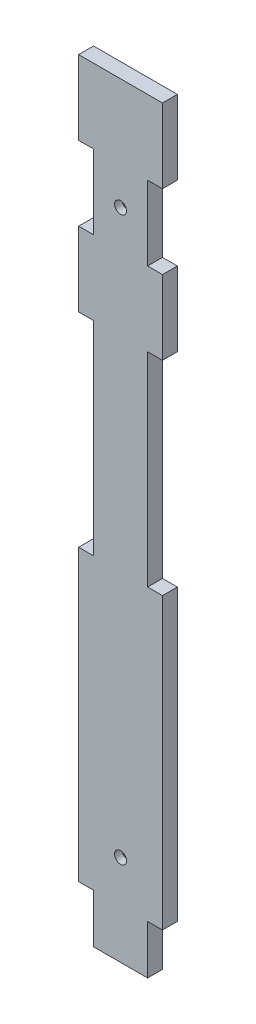
ISO-10303-21;
HEADER;
FILE_DESCRIPTION(('STEP AP214'),'2;1');
FILE_NAME('part.step','',(''),(''),'','','');
FILE_SCHEMA(('AUTOMOTIVE_DESIGN { 1 0 10303 214 1 1 1 1 }'));
ENDSEC;
DATA;
#1=APPLICATION_CONTEXT('core data for automotive mechanical design processes');
#2=APPLICATION_PROTOCOL_DEFINITION('international standard','automotive_design',2000,#1);
#3=PRODUCT_CONTEXT('',#1,'mechanical');
#4=PRODUCT('Part','Part','',(#3));
#5=PRODUCT_RELATED_PRODUCT_CATEGORY('part','',(#4));
#6=PRODUCT_DEFINITION_FORMATION('','',#4);
#7=PRODUCT_DEFINITION_CONTEXT('part definition',#1,'design');
#8=PRODUCT_DEFINITION('design','',#6,#7);
#9=PRODUCT_DEFINITION_SHAPE('','',#8);
#10=(LENGTH_UNIT() NAMED_UNIT(*) SI_UNIT(.MILLI.,.METRE.));
#11=(NAMED_UNIT(*) PLANE_ANGLE_UNIT() SI_UNIT($,.RADIAN.));
#12=(NAMED_UNIT(*) SI_UNIT($,.STERADIAN.) SOLID_ANGLE_UNIT());
#13=UNCERTAINTY_MEASURE_WITH_UNIT(LENGTH_MEASURE(1.E-05),#10,'distance_accuracy_value','');
#14=(GEOMETRIC_REPRESENTATION_CONTEXT(3) GLOBAL_UNCERTAINTY_ASSIGNED_CONTEXT((#13)) GLOBAL_UNIT_ASSIGNED_CONTEXT((#10,
#11,#12)) REPRESENTATION_CONTEXT('',''));
#15=CARTESIAN_POINT('',(0.,0.,0.));
#16=DIRECTION('',(0.,0.,1.));
#17=DIRECTION('',(1.,0.,0.));
#18=AXIS2_PLACEMENT_3D('',#15,#16,#17);
#19=CARTESIAN_POINT('',(0.,0.,10.));
#20=DIRECTION('',(0.,0.,1.));
#21=DIRECTION('',(1.,0.,0.));
#22=AXIS2_PLACEMENT_3D('',#19,#20,#21);
#23=PLANE('',#22);
#24=CARTESIAN_POINT('',(28.2,75.,10.));
#25=DIRECTION('',(0.,0.,1.));
#26=DIRECTION('',(1.,0.,0.));
#27=AXIS2_PLACEMENT_3D('',#24,#25,#26);
#28=CIRCLE('',#27,4.);
#29=CARTESIAN_POINT('',(32.2,75.,10.));
#30=VERTEX_POINT('',#29);
#31=EDGE_CURVE('E231',#30,#30,#28,.T.);
#32=ORIENTED_EDGE('',*,*,#31,.F.);
#33=EDGE_LOOP('',(#32));
#34=FACE_BOUND('',#33,.T.);
#35=DIRECTION('',(1.,0.,0.));
#36=VECTOR('',#35,1.);
#37=CARTESIAN_POINT('',(10.,-1.11022302462516E-13,10.));
#38=LINE('',#37,#36);
#39=CARTESIAN_POINT('',(0.,0.,10.));
#40=VERTEX_POINT('',#39);
#41=CARTESIAN_POINT('',(10.,-1.11022302462516E-13,10.));
#42=VERTEX_POINT('',#41);
#43=EDGE_CURVE('E274',#40,#42,#38,.T.);
#44=ORIENTED_EDGE('',*,*,#43,.T.);
#45=DIRECTION('',(0.,-1.,0.));
#46=VECTOR('',#45,1.);
#47=CARTESIAN_POINT('',(10.,-137.127452116131,10.));
#48=LINE('',#47,#46);
#49=CARTESIAN_POINT('',(10.,-137.127452116131,10.));
#50=VERTEX_POINT('',#49);
#51=EDGE_CURVE('E142',#42,#50,#48,.T.);
#52=ORIENTED_EDGE('',*,*,#51,.T.);
#53=DIRECTION('',(-1.,0.,0.));
#54=VECTOR('',#53,1.);
#55=CARTESIAN_POINT('',(-1.11022302462516E-13,-137.127452116131,10.));
#56=LINE('',#55,#54);
#57=CARTESIAN_POINT('',(-1.11022302462516E-13,-137.127452116131,10.));
#58=VERTEX_POINT('',#57);
#59=EDGE_CURVE('E647',#50,#58,#56,.T.);
#60=ORIENTED_EDGE('',*,*,#59,.T.);
#61=DIRECTION('',(0.,-1.,0.));
#62=VECTOR('',#61,1.);
#63=CARTESIAN_POINT('',(-1.11022302462516E-13,-137.127452116131,10.));
#64=LINE('',#63,#62);
#65=CARTESIAN_POINT('',(0.,-332.021266673399,10.));
#66=VERTEX_POINT('',#65);
#67=EDGE_CURVE('E658',#58,#66,#64,.T.);
#68=ORIENTED_EDGE('',*,*,#67,.T.);
#69=DIRECTION('',(1.,0.,0.));
#70=VECTOR('',#69,1.);
#71=CARTESIAN_POINT('',(0.,-332.021266673399,10.));
#72=LINE('',#71,#70);
#73=CARTESIAN_POINT('',(9.9999999999999,-332.021266673399,10.));
#74=VERTEX_POINT('',#73);
#75=EDGE_CURVE('E655',#66,#74,#72,.T.);
#76=ORIENTED_EDGE('',*,*,#75,.T.);
#77=DIRECTION('',(0.,-1.,0.));
#78=VECTOR('',#77,1.);
#79=CARTESIAN_POINT('',(9.9999999999999,-332.021266673399,10.));
#80=LINE('',#79,#78);
#81=CARTESIAN_POINT('',(9.9999999999999,-364.999999999995,10.));
#82=VERTEX_POINT('',#81);
#83=EDGE_CURVE('E657',#74,#82,#80,.T.);
#84=ORIENTED_EDGE('',*,*,#83,.T.);
#85=DIRECTION('',(1.,0.,0.));
#86=VECTOR('',#85,1.);
#87=CARTESIAN_POINT('',(9.9999999999999,-364.999999999995,10.));
#88=LINE('',#87,#86);
#89=CARTESIAN_POINT('',(46.399999999999,-364.999999999996,10.));
#90=VERTEX_POINT('',#89);
#91=EDGE_CURVE('E660',#82,#90,#88,.T.);
#92=ORIENTED_EDGE('',*,*,#91,.T.);
#93=DIRECTION('',(0.,1.,0.));
#94=VECTOR('',#93,1.);
#95=CARTESIAN_POINT('',(46.399999999999,-364.999999999996,10.));
#96=LINE('',#95,#94);
#97=CARTESIAN_POINT('',(46.399999999999,-332.021266673399,10.));
#98=VERTEX_POINT('',#97);
#99=EDGE_CURVE('E666',#90,#98,#96,.T.);
#100=ORIENTED_EDGE('',*,*,#99,.T.);
#101=DIRECTION('',(1.,0.,0.));
#102=VECTOR('',#101,1.);
#103=CARTESIAN_POINT('',(46.399999999999,-332.021266673399,10.));
#104=LINE('',#103,#102);
#105=CARTESIAN_POINT('',(56.399999999999,-332.021266673399,10.));
#106=VERTEX_POINT('',#105);
#107=EDGE_CURVE('E668',#98,#106,#104,.T.);
#108=ORIENTED_EDGE('',*,*,#107,.T.);
#109=DIRECTION('',(0.,1.,0.));
#110=VECTOR('',#109,1.);
#111=CARTESIAN_POINT('',(56.399999999999,-332.021266673399,10.));
#112=LINE('',#111,#110);
#113=CARTESIAN_POINT('',(56.3999999999991,-137.127452116132,10.));
#114=VERTEX_POINT('',#113);
#115=EDGE_CURVE('E670',#106,#114,#112,.T.);
#116=ORIENTED_EDGE('',*,*,#115,.T.);
#117=DIRECTION('',(-1.,0.,0.));
#118=VECTOR('',#117,1.);
#119=CARTESIAN_POINT('',(46.399999999999,-137.127452116132,10.));
#120=LINE('',#119,#118);
#121=CARTESIAN_POINT('',(46.399999999999,-137.127452116132,10.));
#122=VERTEX_POINT('',#121);
#123=EDGE_CURVE('E672',#114,#122,#120,.T.);
#124=ORIENTED_EDGE('',*,*,#123,.T.);
#125=DIRECTION('',(0.,1.,0.));
#126=VECTOR('',#125,1.);
#127=CARTESIAN_POINT('',(46.399999999999,-6.66133814775094E-13,10.));
#128=LINE('',#127,#126);
#129=CARTESIAN_POINT('',(46.399999999999,-6.66133814775094E-13,10.));
#130=VERTEX_POINT('',#129);
#131=EDGE_CURVE('E674',#122,#130,#128,.T.);
#132=ORIENTED_EDGE('',*,*,#131,.T.);
#133=DIRECTION('',(1.,0.,0.));
#134=VECTOR('',#133,1.);
#135=CARTESIAN_POINT('',(56.4,0.,10.));
#136=LINE('',#135,#134);
#137=CARTESIAN_POINT('',(56.4,0.,10.));
#138=VERTEX_POINT('',#137);
#139=EDGE_CURVE('E676',#130,#138,#136,.T.);
#140=ORIENTED_EDGE('',*,*,#139,.T.);
#141=DIRECTION('',(0.,1.,0.));
#142=VECTOR('',#141,1.);
#143=CARTESIAN_POINT('',(56.4,50.,10.));
#144=LINE('',#143,#142);
#145=CARTESIAN_POINT('',(56.4,50.,10.));
#146=VERTEX_POINT('',#145);
#147=EDGE_CURVE('E678',#138,#146,#144,.T.);
#148=ORIENTED_EDGE('',*,*,#147,.T.);
#149=DIRECTION('',(-1.,0.,0.));
#150=VECTOR('',#149,1.);
#151=CARTESIAN_POINT('',(46.4,50.,10.));
#152=LINE('',#151,#150);
#153=CARTESIAN_POINT('',(46.4,50.,10.));
#154=VERTEX_POINT('',#153);
#155=EDGE_CURVE('E680',#146,#154,#152,.T.);
#156=ORIENTED_EDGE('',*,*,#155,.T.);
#157=DIRECTION('',(0.,1.,0.));
#158=VECTOR('',#157,1.);
#159=CARTESIAN_POINT('',(46.4,100.,10.));
#160=LINE('',#159,#158);
#161=CARTESIAN_POINT('',(46.4,100.,10.));
#162=VERTEX_POINT('',#161);
#163=EDGE_CURVE('E682',#154,#162,#160,.T.);
#164=ORIENTED_EDGE('',*,*,#163,.T.);
#165=DIRECTION('',(1.,0.,0.));
#166=VECTOR('',#165,1.);
#167=CARTESIAN_POINT('',(56.4,100.,10.));
#168=LINE('',#167,#166);
#169=CARTESIAN_POINT('',(56.4,100.,10.));
#170=VERTEX_POINT('',#169);
#171=EDGE_CURVE('E684',#162,#170,#168,.T.);
#172=ORIENTED_EDGE('',*,*,#171,.T.);
#173=DIRECTION('',(0.,1.,0.));
#174=VECTOR('',#173,1.);
#175=CARTESIAN_POINT('',(56.4,150.,10.));
#176=LINE('',#175,#174);
#177=CARTESIAN_POINT('',(56.4,150.,10.));
#178=VERTEX_POINT('',#177);
#179=EDGE_CURVE('E686',#170,#178,#176,.T.);
#180=ORIENTED_EDGE('',*,*,#179,.T.);
#181=DIRECTION('',(-1.,0.,0.));
#182=VECTOR('',#181,1.);
#183=CARTESIAN_POINT('',(0.,150.,10.));
#184=LINE('',#183,#182);
#185=CARTESIAN_POINT('',(0.,150.,10.));
#186=VERTEX_POINT('',#185);
#187=EDGE_CURVE('E688',#178,#186,#184,.T.);
#188=ORIENTED_EDGE('',*,*,#187,.T.);
#189=DIRECTION('',(0.,-1.,0.));
#190=VECTOR('',#189,1.);
#191=CARTESIAN_POINT('',(0.,150.,10.));
#192=LINE('',#191,#190);
#193=CARTESIAN_POINT('',(0.,100.,10.));
#194=VERTEX_POINT('',#193);
#195=EDGE_CURVE('E690',#186,#194,#192,.T.);
#196=ORIENTED_EDGE('',*,*,#195,.T.);
#197=DIRECTION('',(1.,0.,0.));
#198=VECTOR('',#197,1.);
#199=CARTESIAN_POINT('',(0.,100.,10.));
#200=LINE('',#199,#198);
#201=CARTESIAN_POINT('',(9.99999999999997,100.,10.));
#202=VERTEX_POINT('',#201);
#203=EDGE_CURVE('E209',#194,#202,#200,.T.);
#204=ORIENTED_EDGE('',*,*,#203,.T.);
#205=DIRECTION('',(0.,-1.,0.));
#206=VECTOR('',#205,1.);
#207=CARTESIAN_POINT('',(9.99999999999997,100.,10.));
#208=LINE('',#207,#206);
#209=CARTESIAN_POINT('',(9.99999999999996,50.,10.));
#210=VERTEX_POINT('',#209);
#211=EDGE_CURVE('E203',#202,#210,#208,.T.);
#212=ORIENTED_EDGE('',*,*,#211,.T.);
#213=DIRECTION('',(-1.,0.,0.));
#214=VECTOR('',#213,1.);
#215=CARTESIAN_POINT('',(9.99999999999996,50.,10.));
#216=LINE('',#215,#214);
#217=CARTESIAN_POINT('',(0.,50.,10.));
#218=VERTEX_POINT('',#217);
#219=EDGE_CURVE('E207',#210,#218,#216,.T.);
#220=ORIENTED_EDGE('',*,*,#219,.T.);
#221=DIRECTION('',(0.,-1.,0.));
#222=VECTOR('',#221,1.);
#223=CARTESIAN_POINT('',(0.,50.,10.));
#224=LINE('',#223,#222);
#225=EDGE_CURVE('E50',#218,#40,#224,.T.);
#226=ORIENTED_EDGE('',*,*,#225,.T.);
#227=EDGE_LOOP('',(#44,#52,#60,#68,#76,#84,#92,#100,#108,#116,#124,#132,#140,#148,#156,#164,
#172,#180,#188,#196,#204,#212,#220,#226));
#228=FACE_BOUND('',#227,.T.);
#229=CARTESIAN_POINT('',(28.2,-303.821266673398,10.));
#230=DIRECTION('',(0.,0.,1.));
#231=DIRECTION('',(1.,0.,0.));
#232=AXIS2_PLACEMENT_3D('',#229,#230,#231);
#233=CIRCLE('',#232,4.);
#234=CARTESIAN_POINT('',(32.2,-303.821266673398,10.));
#235=VERTEX_POINT('',#234);
#236=EDGE_CURVE('E740',#235,#235,#233,.T.);
#237=ORIENTED_EDGE('',*,*,#236,.F.);
#238=EDGE_LOOP('',(#237));
#239=FACE_BOUND('',#238,.T.);
#240=ADVANCED_FACE('F33',(#34,#228,#239),#23,.T.);
#241=CARTESIAN_POINT('',(0.,0.,0.));
#242=DIRECTION('',(0.,0.,1.));
#243=DIRECTION('',(1.,0.,0.));
#244=AXIS2_PLACEMENT_3D('',#241,#242,#243);
#245=PLANE('',#244);
#246=CARTESIAN_POINT('',(28.2,-303.821266673398,0.));
#247=DIRECTION('',(0.,0.,1.));
#248=DIRECTION('',(1.,0.,0.));
#249=AXIS2_PLACEMENT_3D('',#246,#247,#248);
#250=CIRCLE('',#249,9.00000000000007);
#251=CARTESIAN_POINT('',(37.2,-303.821266673398,0.));
#252=VERTEX_POINT('',#251);
#253=EDGE_CURVE('E340',#252,#252,#250,.T.);
#254=ORIENTED_EDGE('',*,*,#253,.T.);
#255=EDGE_LOOP('',(#254));
#256=FACE_BOUND('',#255,.T.);
#257=CARTESIAN_POINT('',(28.2,75.,0.));
#258=DIRECTION('',(0.,0.,1.));
#259=DIRECTION('',(1.,0.,0.));
#260=AXIS2_PLACEMENT_3D('',#257,#258,#259);
#261=CIRCLE('',#260,9.00000000000006);
#262=CARTESIAN_POINT('',(37.2000000000001,75.,0.));
#263=VERTEX_POINT('',#262);
#264=EDGE_CURVE('E337',#263,#263,#261,.T.);
#265=ORIENTED_EDGE('',*,*,#264,.T.);
#266=EDGE_LOOP('',(#265));
#267=FACE_BOUND('',#266,.T.);
#268=DIRECTION('',(1.,0.,0.));
#269=VECTOR('',#268,1.);
#270=CARTESIAN_POINT('',(10.,-1.11022302462516E-13,0.));
#271=LINE('',#270,#269);
#272=CARTESIAN_POINT('',(0.,0.,0.));
#273=VERTEX_POINT('',#272);
#274=CARTESIAN_POINT('',(10.,-1.11022302462516E-13,0.));
#275=VERTEX_POINT('',#274);
#276=EDGE_CURVE('E227',#273,#275,#271,.T.);
#277=ORIENTED_EDGE('',*,*,#276,.F.);
#278=DIRECTION('',(0.,-1.,0.));
#279=VECTOR('',#278,1.);
#280=CARTESIAN_POINT('',(0.,50.,0.));
#281=LINE('',#280,#279);
#282=CARTESIAN_POINT('',(0.,50.,0.));
#283=VERTEX_POINT('',#282);
#284=EDGE_CURVE('E133',#283,#273,#281,.T.);
#285=ORIENTED_EDGE('',*,*,#284,.F.);
#286=DIRECTION('',(-1.,0.,0.));
#287=VECTOR('',#286,1.);
#288=CARTESIAN_POINT('',(9.99999999999996,50.,0.));
#289=LINE('',#288,#287);
#290=CARTESIAN_POINT('',(9.99999999999996,50.,0.));
#291=VERTEX_POINT('',#290);
#292=EDGE_CURVE('E127',#291,#283,#289,.T.);
#293=ORIENTED_EDGE('',*,*,#292,.F.);
#294=DIRECTION('',(0.,-1.,0.));
#295=VECTOR('',#294,1.);
#296=CARTESIAN_POINT('',(9.99999999999997,100.,0.));
#297=LINE('',#296,#295);
#298=CARTESIAN_POINT('',(9.99999999999997,100.,0.));
#299=VERTEX_POINT('',#298);
#300=EDGE_CURVE('E217',#299,#291,#297,.T.);
#301=ORIENTED_EDGE('',*,*,#300,.F.);
#302=DIRECTION('',(1.,0.,0.));
#303=VECTOR('',#302,1.);
#304=CARTESIAN_POINT('',(0.,100.,0.));
#305=LINE('',#304,#303);
#306=CARTESIAN_POINT('',(0.,100.,0.));
#307=VERTEX_POINT('',#306);
#308=EDGE_CURVE('E269',#307,#299,#305,.T.);
#309=ORIENTED_EDGE('',*,*,#308,.F.);
#310=DIRECTION('',(0.,-1.,0.));
#311=VECTOR('',#310,1.);
#312=CARTESIAN_POINT('',(0.,150.,0.));
#313=LINE('',#312,#311);
#314=CARTESIAN_POINT('',(0.,150.,0.));
#315=VERTEX_POINT('',#314);
#316=EDGE_CURVE('E267',#315,#307,#313,.T.);
#317=ORIENTED_EDGE('',*,*,#316,.F.);
#318=DIRECTION('',(-1.,0.,0.));
#319=VECTOR('',#318,1.);
#320=CARTESIAN_POINT('',(0.,150.,0.));
#321=LINE('',#320,#319);
#322=CARTESIAN_POINT('',(56.4,150.,0.));
#323=VERTEX_POINT('',#322);
#324=EDGE_CURVE('E265',#323,#315,#321,.T.);
#325=ORIENTED_EDGE('',*,*,#324,.F.);
#326=DIRECTION('',(0.,1.,0.));
#327=VECTOR('',#326,1.);
#328=CARTESIAN_POINT('',(56.4,150.,0.));
#329=LINE('',#328,#327);
#330=CARTESIAN_POINT('',(56.4,100.,0.));
#331=VERTEX_POINT('',#330);
#332=EDGE_CURVE('E263',#331,#323,#329,.T.);
#333=ORIENTED_EDGE('',*,*,#332,.F.);
#334=DIRECTION('',(1.,0.,0.));
#335=VECTOR('',#334,1.);
#336=CARTESIAN_POINT('',(56.4,100.,0.));
#337=LINE('',#336,#335);
#338=CARTESIAN_POINT('',(46.4,100.,0.));
#339=VERTEX_POINT('',#338);
#340=EDGE_CURVE('E261',#339,#331,#337,.T.);
#341=ORIENTED_EDGE('',*,*,#340,.F.);
#342=DIRECTION('',(0.,1.,0.));
#343=VECTOR('',#342,1.);
#344=CARTESIAN_POINT('',(46.4,100.,0.));
#345=LINE('',#344,#343);
#346=CARTESIAN_POINT('',(46.4,50.,0.));
#347=VERTEX_POINT('',#346);
#348=EDGE_CURVE('E259',#347,#339,#345,.T.);
#349=ORIENTED_EDGE('',*,*,#348,.F.);
#350=DIRECTION('',(-1.,0.,0.));
#351=VECTOR('',#350,1.);
#352=CARTESIAN_POINT('',(46.4,50.,0.));
#353=LINE('',#352,#351);
#354=CARTESIAN_POINT('',(56.4,50.,0.));
#355=VERTEX_POINT('',#354);
#356=EDGE_CURVE('E257',#355,#347,#353,.T.);
#357=ORIENTED_EDGE('',*,*,#356,.F.);
#358=DIRECTION('',(0.,1.,0.));
#359=VECTOR('',#358,1.);
#360=CARTESIAN_POINT('',(56.4,50.,0.));
#361=LINE('',#360,#359);
#362=CARTESIAN_POINT('',(56.4,0.,0.));
#363=VERTEX_POINT('',#362);
#364=EDGE_CURVE('E255',#363,#355,#361,.T.);
#365=ORIENTED_EDGE('',*,*,#364,.F.);
#366=DIRECTION('',(1.,0.,0.));
#367=VECTOR('',#366,1.);
#368=CARTESIAN_POINT('',(56.4,0.,0.));
#369=LINE('',#368,#367);
#370=CARTESIAN_POINT('',(46.399999999999,-6.66133814775094E-13,0.));
#371=VERTEX_POINT('',#370);
#372=EDGE_CURVE('E253',#371,#363,#369,.T.);
#373=ORIENTED_EDGE('',*,*,#372,.F.);
#374=DIRECTION('',(0.,1.,0.));
#375=VECTOR('',#374,1.);
#376=CARTESIAN_POINT('',(46.399999999999,-6.66133814775094E-13,0.));
#377=LINE('',#376,#375);
#378=CARTESIAN_POINT('',(46.399999999999,-137.127452116132,0.));
#379=VERTEX_POINT('',#378);
#380=EDGE_CURVE('E251',#379,#371,#377,.T.);
#381=ORIENTED_EDGE('',*,*,#380,.F.);
#382=DIRECTION('',(-1.,0.,0.));
#383=VECTOR('',#382,1.);
#384=CARTESIAN_POINT('',(46.399999999999,-137.127452116132,0.));
#385=LINE('',#384,#383);
#386=CARTESIAN_POINT('',(56.3999999999991,-137.127452116132,0.));
#387=VERTEX_POINT('',#386);
#388=EDGE_CURVE('E249',#387,#379,#385,.T.);
#389=ORIENTED_EDGE('',*,*,#388,.F.);
#390=DIRECTION('',(0.,1.,0.));
#391=VECTOR('',#390,1.);
#392=CARTESIAN_POINT('',(56.399999999999,-332.021266673399,0.));
#393=LINE('',#392,#391);
#394=CARTESIAN_POINT('',(56.399999999999,-332.021266673399,0.));
#395=VERTEX_POINT('',#394);
#396=EDGE_CURVE('E247',#395,#387,#393,.T.);
#397=ORIENTED_EDGE('',*,*,#396,.F.);
#398=DIRECTION('',(1.,0.,0.));
#399=VECTOR('',#398,1.);
#400=CARTESIAN_POINT('',(46.399999999999,-332.021266673399,0.));
#401=LINE('',#400,#399);
#402=CARTESIAN_POINT('',(46.399999999999,-332.021266673399,0.));
#403=VERTEX_POINT('',#402);
#404=EDGE_CURVE('E245',#403,#395,#401,.T.);
#405=ORIENTED_EDGE('',*,*,#404,.F.);
#406=DIRECTION('',(0.,1.,0.));
#407=VECTOR('',#406,1.);
#408=CARTESIAN_POINT('',(46.399999999999,-364.999999999996,0.));
#409=LINE('',#408,#407);
#410=CARTESIAN_POINT('',(46.399999999999,-364.999999999996,0.));
#411=VERTEX_POINT('',#410);
#412=EDGE_CURVE('E243',#411,#403,#409,.T.);
#413=ORIENTED_EDGE('',*,*,#412,.F.);
#414=DIRECTION('',(1.,0.,0.));
#415=VECTOR('',#414,1.);
#416=CARTESIAN_POINT('',(9.9999999999999,-364.999999999995,0.));
#417=LINE('',#416,#415);
#418=CARTESIAN_POINT('',(9.9999999999999,-364.999999999995,0.));
#419=VERTEX_POINT('',#418);
#420=EDGE_CURVE('E241',#419,#411,#417,.T.);
#421=ORIENTED_EDGE('',*,*,#420,.F.);
#422=DIRECTION('',(0.,-1.,0.));
#423=VECTOR('',#422,1.);
#424=CARTESIAN_POINT('',(9.9999999999999,-332.021266673399,0.));
#425=LINE('',#424,#423);
#426=CARTESIAN_POINT('',(9.9999999999999,-332.021266673399,0.));
#427=VERTEX_POINT('',#426);
#428=EDGE_CURVE('E239',#427,#419,#425,.T.);
#429=ORIENTED_EDGE('',*,*,#428,.F.);
#430=DIRECTION('',(1.,0.,0.));
#431=VECTOR('',#430,1.);
#432=CARTESIAN_POINT('',(0.,-332.021266673399,0.));
#433=LINE('',#432,#431);
#434=CARTESIAN_POINT('',(0.,-332.021266673399,0.));
#435=VERTEX_POINT('',#434);
#436=EDGE_CURVE('E237',#435,#427,#433,.T.);
#437=ORIENTED_EDGE('',*,*,#436,.F.);
#438=DIRECTION('',(0.,-1.,0.));
#439=VECTOR('',#438,1.);
#440=CARTESIAN_POINT('',(-1.11022302462516E-13,-137.127452116131,0.));
#441=LINE('',#440,#439);
#442=CARTESIAN_POINT('',(-1.11022302462516E-13,-137.127452116131,0.));
#443=VERTEX_POINT('',#442);
#444=EDGE_CURVE('E235',#443,#435,#441,.T.);
#445=ORIENTED_EDGE('',*,*,#444,.F.);
#446=DIRECTION('',(-1.,0.,0.));
#447=VECTOR('',#446,1.);
#448=CARTESIAN_POINT('',(-1.11022302462516E-13,-137.127452116131,0.));
#449=LINE('',#448,#447);
#450=CARTESIAN_POINT('',(10.,-137.127452116131,0.));
#451=VERTEX_POINT('',#450);
#452=EDGE_CURVE('E233',#451,#443,#449,.T.);
#453=ORIENTED_EDGE('',*,*,#452,.F.);
#454=DIRECTION('',(0.,-1.,0.));
#455=VECTOR('',#454,1.);
#456=CARTESIAN_POINT('',(10.,-137.127452116131,0.));
#457=LINE('',#456,#455);
#458=EDGE_CURVE('E230',#275,#451,#457,.T.);
#459=ORIENTED_EDGE('',*,*,#458,.F.);
#460=EDGE_LOOP('',(#277,#285,#293,#301,#309,#317,#325,#333,#341,#349,#357,#365,#373,#381,#389,
#397,#405,#413,#421,#429,#437,#445,#453,#459));
#461=FACE_BOUND('',#460,.T.);
#462=ADVANCED_FACE('F353',(#256,#267,#461),#245,.F.);
#463=CARTESIAN_POINT('',(10.,-1.11022302462516E-13,10.));
#464=DIRECTION('',(0.,1.,0.));
#465=DIRECTION('',(-1.,0.,0.));
#466=AXIS2_PLACEMENT_3D('',#463,#464,#465);
#467=PLANE('',#466);
#468=ORIENTED_EDGE('',*,*,#276,.T.);
#469=DIRECTION('',(0.,0.,-1.));
#470=VECTOR('',#469,1.);
#471=CARTESIAN_POINT('',(10.,-1.11022302462516E-13,10.));
#472=LINE('',#471,#470);
#473=EDGE_CURVE('E335',#42,#275,#472,.T.);
#474=ORIENTED_EDGE('',*,*,#473,.F.);
#475=ORIENTED_EDGE('',*,*,#43,.F.);
#476=DIRECTION('',(0.,0.,-1.));
#477=VECTOR('',#476,1.);
#478=CARTESIAN_POINT('',(0.,0.,10.));
#479=LINE('',#478,#477);
#480=EDGE_CURVE('E223',#40,#273,#479,.T.);
#481=ORIENTED_EDGE('',*,*,#480,.T.);
#482=EDGE_LOOP('',(#468,#474,#475,#481));
#483=FACE_BOUND('',#482,.T.);
#484=ADVANCED_FACE('F356',(#483),#467,.F.);
#485=CARTESIAN_POINT('',(10.,-137.127452116131,10.));
#486=DIRECTION('',(1.,0.,0.));
#487=DIRECTION('',(0.,0.,-1.));
#488=AXIS2_PLACEMENT_3D('',#485,#486,#487);
#489=PLANE('',#488);
#490=ORIENTED_EDGE('',*,*,#458,.T.);
#491=DIRECTION('',(0.,0.,-1.));
#492=VECTOR('',#491,1.);
#493=CARTESIAN_POINT('',(10.,-137.127452116131,10.));
#494=LINE('',#493,#492);
#495=EDGE_CURVE('E332',#50,#451,#494,.T.);
#496=ORIENTED_EDGE('',*,*,#495,.F.);
#497=ORIENTED_EDGE('',*,*,#51,.F.);
#498=ORIENTED_EDGE('',*,*,#473,.T.);
#499=EDGE_LOOP('',(#490,#496,#497,#498));
#500=FACE_BOUND('',#499,.T.);
#501=ADVANCED_FACE('F596',(#500),#489,.F.);
#502=CARTESIAN_POINT('',(-1.11022302462516E-13,-137.127452116131,10.));
#503=DIRECTION('',(0.,-1.,0.));
#504=DIRECTION('',(0.,0.,-1.));
#505=AXIS2_PLACEMENT_3D('',#502,#503,#504);
#506=PLANE('',#505);
#507=ORIENTED_EDGE('',*,*,#452,.T.);
#508=DIRECTION('',(0.,0.,-1.));
#509=VECTOR('',#508,1.);
#510=CARTESIAN_POINT('',(-1.11022302462516E-13,-137.127452116131,10.));
#511=LINE('',#510,#509);
#512=EDGE_CURVE('E329',#58,#443,#511,.T.);
#513=ORIENTED_EDGE('',*,*,#512,.F.);
#514=ORIENTED_EDGE('',*,*,#59,.F.);
#515=ORIENTED_EDGE('',*,*,#495,.T.);
#516=EDGE_LOOP('',(#507,#513,#514,#515));
#517=FACE_BOUND('',#516,.T.);
#518=ADVANCED_FACE('F587',(#517),#506,.F.);
#519=CARTESIAN_POINT('',(-1.11022302462516E-13,-137.127452116131,10.));
#520=DIRECTION('',(1.,0.,0.));
#521=DIRECTION('',(0.,1.,0.));
#522=AXIS2_PLACEMENT_3D('',#519,#520,#521);
#523=PLANE('',#522);
#524=ORIENTED_EDGE('',*,*,#444,.T.);
#525=DIRECTION('',(0.,0.,-1.));
#526=VECTOR('',#525,1.);
#527=CARTESIAN_POINT('',(0.,-332.021266673399,10.));
#528=LINE('',#527,#526);
#529=EDGE_CURVE('E326',#66,#435,#528,.T.);
#530=ORIENTED_EDGE('',*,*,#529,.F.);
#531=ORIENTED_EDGE('',*,*,#67,.F.);
#532=ORIENTED_EDGE('',*,*,#512,.T.);
#533=EDGE_LOOP('',(#524,#530,#531,#532));
#534=FACE_BOUND('',#533,.T.);
#535=ADVANCED_FACE('F578',(#534),#523,.F.);
#536=CARTESIAN_POINT('',(0.,-332.021266673399,10.));
#537=DIRECTION('',(0.,1.,0.));
#538=DIRECTION('',(0.,0.,1.));
#539=AXIS2_PLACEMENT_3D('',#536,#537,#538);
#540=PLANE('',#539);
#541=ORIENTED_EDGE('',*,*,#436,.T.);
#542=DIRECTION('',(0.,0.,-1.));
#543=VECTOR('',#542,1.);
#544=CARTESIAN_POINT('',(9.9999999999999,-332.021266673399,10.));
#545=LINE('',#544,#543);
#546=EDGE_CURVE('E323',#74,#427,#545,.T.);
#547=ORIENTED_EDGE('',*,*,#546,.F.);
#548=ORIENTED_EDGE('',*,*,#75,.F.);
#549=ORIENTED_EDGE('',*,*,#529,.T.);
#550=EDGE_LOOP('',(#541,#547,#548,#549));
#551=FACE_BOUND('',#550,.T.);
#552=ADVANCED_FACE('F569',(#551),#540,.F.);
#553=CARTESIAN_POINT('',(9.9999999999999,-332.021266673399,10.));
#554=DIRECTION('',(1.,0.,0.));
#555=DIRECTION('',(0.,0.,-1.));
#556=AXIS2_PLACEMENT_3D('',#553,#554,#555);
#557=PLANE('',#556);
#558=ORIENTED_EDGE('',*,*,#428,.T.);
#559=DIRECTION('',(0.,0.,-1.));
#560=VECTOR('',#559,1.);
#561=CARTESIAN_POINT('',(9.9999999999999,-364.999999999995,10.));
#562=LINE('',#561,#560);
#563=EDGE_CURVE('E320',#82,#419,#562,.T.);
#564=ORIENTED_EDGE('',*,*,#563,.F.);
#565=ORIENTED_EDGE('',*,*,#83,.F.);
#566=ORIENTED_EDGE('',*,*,#546,.T.);
#567=EDGE_LOOP('',(#558,#564,#565,#566));
#568=FACE_BOUND('',#567,.T.);
#569=ADVANCED_FACE('F560',(#568),#557,.F.);
#570=CARTESIAN_POINT('',(9.9999999999999,-364.999999999995,10.));
#571=DIRECTION('',(0.,1.,0.));
#572=DIRECTION('',(-1.,0.,0.));
#573=AXIS2_PLACEMENT_3D('',#570,#571,#572);
#574=PLANE('',#573);
#575=ORIENTED_EDGE('',*,*,#420,.T.);
#576=DIRECTION('',(0.,0.,-1.));
#577=VECTOR('',#576,1.);
#578=CARTESIAN_POINT('',(46.399999999999,-364.999999999996,10.));
#579=LINE('',#578,#577);
#580=EDGE_CURVE('E317',#90,#411,#579,.T.);
#581=ORIENTED_EDGE('',*,*,#580,.F.);
#582=ORIENTED_EDGE('',*,*,#91,.F.);
#583=ORIENTED_EDGE('',*,*,#563,.T.);
#584=EDGE_LOOP('',(#575,#581,#582,#583));
#585=FACE_BOUND('',#584,.T.);
#586=ADVANCED_FACE('F551',(#585),#574,.F.);
#587=CARTESIAN_POINT('',(46.399999999999,-364.999999999996,10.));
#588=DIRECTION('',(-1.,0.,0.));
#589=DIRECTION('',(0.,0.,1.));
#590=AXIS2_PLACEMENT_3D('',#587,#588,#589);
#591=PLANE('',#590);
#592=ORIENTED_EDGE('',*,*,#412,.T.);
#593=DIRECTION('',(0.,0.,-1.));
#594=VECTOR('',#593,1.);
#595=CARTESIAN_POINT('',(46.399999999999,-332.021266673399,10.));
#596=LINE('',#595,#594);
#597=EDGE_CURVE('E314',#98,#403,#596,.T.);
#598=ORIENTED_EDGE('',*,*,#597,.F.);
#599=ORIENTED_EDGE('',*,*,#99,.F.);
#600=ORIENTED_EDGE('',*,*,#580,.T.);
#601=EDGE_LOOP('',(#592,#598,#599,#600));
#602=FACE_BOUND('',#601,.T.);
#603=ADVANCED_FACE('F542',(#602),#591,.F.);
#604=CARTESIAN_POINT('',(46.399999999999,-332.021266673399,10.));
#605=DIRECTION('',(0.,1.,0.));
#606=DIRECTION('',(0.,0.,1.));
#607=AXIS2_PLACEMENT_3D('',#604,#605,#606);
#608=PLANE('',#607);
#609=ORIENTED_EDGE('',*,*,#404,.T.);
#610=DIRECTION('',(0.,0.,-1.));
#611=VECTOR('',#610,1.);
#612=CARTESIAN_POINT('',(56.399999999999,-332.021266673399,10.));
#613=LINE('',#612,#611);
#614=EDGE_CURVE('E311',#106,#395,#613,.T.);
#615=ORIENTED_EDGE('',*,*,#614,.F.);
#616=ORIENTED_EDGE('',*,*,#107,.F.);
#617=ORIENTED_EDGE('',*,*,#597,.T.);
#618=EDGE_LOOP('',(#609,#615,#616,#617));
#619=FACE_BOUND('',#618,.T.);
#620=ADVANCED_FACE('F533',(#619),#608,.F.);
#621=CARTESIAN_POINT('',(56.399999999999,-332.021266673399,10.));
#622=DIRECTION('',(-1.,0.,0.));
#623=DIRECTION('',(0.,-1.,0.));
#624=AXIS2_PLACEMENT_3D('',#621,#622,#623);
#625=PLANE('',#624);
#626=ORIENTED_EDGE('',*,*,#396,.T.);
#627=DIRECTION('',(0.,0.,-1.));
#628=VECTOR('',#627,1.);
#629=CARTESIAN_POINT('',(56.3999999999991,-137.127452116132,10.));
#630=LINE('',#629,#628);
#631=EDGE_CURVE('E308',#114,#387,#630,.T.);
#632=ORIENTED_EDGE('',*,*,#631,.F.);
#633=ORIENTED_EDGE('',*,*,#115,.F.);
#634=ORIENTED_EDGE('',*,*,#614,.T.);
#635=EDGE_LOOP('',(#626,#632,#633,#634));
#636=FACE_BOUND('',#635,.T.);
#637=ADVANCED_FACE('F524',(#636),#625,.F.);
#638=CARTESIAN_POINT('',(46.399999999999,-137.127452116132,10.));
#639=DIRECTION('',(0.,-1.,0.));
#640=DIRECTION('',(0.,0.,-1.));
#641=AXIS2_PLACEMENT_3D('',#638,#639,#640);
#642=PLANE('',#641);
#643=ORIENTED_EDGE('',*,*,#388,.T.);
#644=DIRECTION('',(0.,0.,-1.));
#645=VECTOR('',#644,1.);
#646=CARTESIAN_POINT('',(46.399999999999,-137.127452116132,10.));
#647=LINE('',#646,#645);
#648=EDGE_CURVE('E305',#122,#379,#647,.T.);
#649=ORIENTED_EDGE('',*,*,#648,.F.);
#650=ORIENTED_EDGE('',*,*,#123,.F.);
#651=ORIENTED_EDGE('',*,*,#631,.T.);
#652=EDGE_LOOP('',(#643,#649,#650,#651));
#653=FACE_BOUND('',#652,.T.);
#654=ADVANCED_FACE('F515',(#653),#642,.F.);
#655=CARTESIAN_POINT('',(46.399999999999,-6.66133814775094E-13,10.));
#656=DIRECTION('',(-1.,0.,0.));
#657=DIRECTION('',(0.,0.,1.));
#658=AXIS2_PLACEMENT_3D('',#655,#656,#657);
#659=PLANE('',#658);
#660=ORIENTED_EDGE('',*,*,#380,.T.);
#661=DIRECTION('',(0.,0.,-1.));
#662=VECTOR('',#661,1.);
#663=CARTESIAN_POINT('',(46.399999999999,-6.66133814775094E-13,10.));
#664=LINE('',#663,#662);
#665=EDGE_CURVE('E302',#130,#371,#664,.T.);
#666=ORIENTED_EDGE('',*,*,#665,.F.);
#667=ORIENTED_EDGE('',*,*,#131,.F.);
#668=ORIENTED_EDGE('',*,*,#648,.T.);
#669=EDGE_LOOP('',(#660,#666,#667,#668));
#670=FACE_BOUND('',#669,.T.);
#671=ADVANCED_FACE('F506',(#670),#659,.F.);
#672=CARTESIAN_POINT('',(56.4,0.,10.));
#673=DIRECTION('',(0.,1.,0.));
#674=DIRECTION('',(-1.,0.,0.));
#675=AXIS2_PLACEMENT_3D('',#672,#673,#674);
#676=PLANE('',#675);
#677=ORIENTED_EDGE('',*,*,#372,.T.);
#678=DIRECTION('',(0.,0.,-1.));
#679=VECTOR('',#678,1.);
#680=CARTESIAN_POINT('',(56.4,0.,10.));
#681=LINE('',#680,#679);
#682=EDGE_CURVE('E299',#138,#363,#681,.T.);
#683=ORIENTED_EDGE('',*,*,#682,.F.);
#684=ORIENTED_EDGE('',*,*,#139,.F.);
#685=ORIENTED_EDGE('',*,*,#665,.T.);
#686=EDGE_LOOP('',(#677,#683,#684,#685));
#687=FACE_BOUND('',#686,.T.);
#688=ADVANCED_FACE('F497',(#687),#676,.F.);
#689=CARTESIAN_POINT('',(56.4,50.,10.));
#690=DIRECTION('',(-1.,0.,0.));
#691=DIRECTION('',(0.,-1.,0.));
#692=AXIS2_PLACEMENT_3D('',#689,#690,#691);
#693=PLANE('',#692);
#694=ORIENTED_EDGE('',*,*,#364,.T.);
#695=DIRECTION('',(0.,0.,-1.));
#696=VECTOR('',#695,1.);
#697=CARTESIAN_POINT('',(56.4,50.,10.));
#698=LINE('',#697,#696);
#699=EDGE_CURVE('E296',#146,#355,#698,.T.);
#700=ORIENTED_EDGE('',*,*,#699,.F.);
#701=ORIENTED_EDGE('',*,*,#147,.F.);
#702=ORIENTED_EDGE('',*,*,#682,.T.);
#703=EDGE_LOOP('',(#694,#700,#701,#702));
#704=FACE_BOUND('',#703,.T.);
#705=ADVANCED_FACE('F488',(#704),#693,.F.);
#706=CARTESIAN_POINT('',(46.4,50.,10.));
#707=DIRECTION('',(0.,-1.,0.));
#708=DIRECTION('',(1.,0.,0.));
#709=AXIS2_PLACEMENT_3D('',#706,#707,#708);
#710=PLANE('',#709);
#711=ORIENTED_EDGE('',*,*,#356,.T.);
#712=DIRECTION('',(0.,0.,-1.));
#713=VECTOR('',#712,1.);
#714=CARTESIAN_POINT('',(46.4,50.,10.));
#715=LINE('',#714,#713);
#716=EDGE_CURVE('E293',#154,#347,#715,.T.);
#717=ORIENTED_EDGE('',*,*,#716,.F.);
#718=ORIENTED_EDGE('',*,*,#155,.F.);
#719=ORIENTED_EDGE('',*,*,#699,.T.);
#720=EDGE_LOOP('',(#711,#717,#718,#719));
#721=FACE_BOUND('',#720,.T.);
#722=ADVANCED_FACE('F479',(#721),#710,.F.);
#723=CARTESIAN_POINT('',(46.4,100.,10.));
#724=DIRECTION('',(-1.,0.,0.));
#725=DIRECTION('',(0.,-1.,0.));
#726=AXIS2_PLACEMENT_3D('',#723,#724,#725);
#727=PLANE('',#726);
#728=ORIENTED_EDGE('',*,*,#348,.T.);
#729=DIRECTION('',(0.,0.,-1.));
#730=VECTOR('',#729,1.);
#731=CARTESIAN_POINT('',(46.4,100.,10.));
#732=LINE('',#731,#730);
#733=EDGE_CURVE('E290',#162,#339,#732,.T.);
#734=ORIENTED_EDGE('',*,*,#733,.F.);
#735=ORIENTED_EDGE('',*,*,#163,.F.);
#736=ORIENTED_EDGE('',*,*,#716,.T.);
#737=EDGE_LOOP('',(#728,#734,#735,#736));
#738=FACE_BOUND('',#737,.T.);
#739=ADVANCED_FACE('F470',(#738),#727,.F.);
#740=CARTESIAN_POINT('',(56.4,100.,10.));
#741=DIRECTION('',(0.,1.,0.));
#742=DIRECTION('',(0.,0.,1.));
#743=AXIS2_PLACEMENT_3D('',#740,#741,#742);
#744=PLANE('',#743);
#745=ORIENTED_EDGE('',*,*,#340,.T.);
#746=DIRECTION('',(0.,0.,-1.));
#747=VECTOR('',#746,1.);
#748=CARTESIAN_POINT('',(56.4,100.,10.));
#749=LINE('',#748,#747);
#750=EDGE_CURVE('E287',#170,#331,#749,.T.);
#751=ORIENTED_EDGE('',*,*,#750,.F.);
#752=ORIENTED_EDGE('',*,*,#171,.F.);
#753=ORIENTED_EDGE('',*,*,#733,.T.);
#754=EDGE_LOOP('',(#745,#751,#752,#753));
#755=FACE_BOUND('',#754,.T.);
#756=ADVANCED_FACE('F461',(#755),#744,.F.);
#757=CARTESIAN_POINT('',(56.4,150.,10.));
#758=DIRECTION('',(-1.,0.,0.));
#759=DIRECTION('',(0.,-1.,0.));
#760=AXIS2_PLACEMENT_3D('',#757,#758,#759);
#761=PLANE('',#760);
#762=ORIENTED_EDGE('',*,*,#332,.T.);
#763=DIRECTION('',(0.,0.,-1.));
#764=VECTOR('',#763,1.);
#765=CARTESIAN_POINT('',(56.4,150.,10.));
#766=LINE('',#765,#764);
#767=EDGE_CURVE('E284',#178,#323,#766,.T.);
#768=ORIENTED_EDGE('',*,*,#767,.F.);
#769=ORIENTED_EDGE('',*,*,#179,.F.);
#770=ORIENTED_EDGE('',*,*,#750,.T.);
#771=EDGE_LOOP('',(#762,#768,#769,#770));
#772=FACE_BOUND('',#771,.T.);
#773=ADVANCED_FACE('F452',(#772),#761,.F.);
#774=CARTESIAN_POINT('',(0.,150.,10.));
#775=DIRECTION('',(0.,-1.,0.));
#776=DIRECTION('',(0.,0.,-1.));
#777=AXIS2_PLACEMENT_3D('',#774,#775,#776);
#778=PLANE('',#777);
#779=ORIENTED_EDGE('',*,*,#324,.T.);
#780=DIRECTION('',(0.,0.,-1.));
#781=VECTOR('',#780,1.);
#782=CARTESIAN_POINT('',(0.,150.,10.));
#783=LINE('',#782,#781);
#784=EDGE_CURVE('E281',#186,#315,#783,.T.);
#785=ORIENTED_EDGE('',*,*,#784,.F.);
#786=ORIENTED_EDGE('',*,*,#187,.F.);
#787=ORIENTED_EDGE('',*,*,#767,.T.);
#788=EDGE_LOOP('',(#779,#785,#786,#787));
#789=FACE_BOUND('',#788,.T.);
#790=ADVANCED_FACE('F443',(#789),#778,.F.);
#791=CARTESIAN_POINT('',(0.,150.,10.));
#792=DIRECTION('',(1.,0.,0.));
#793=DIRECTION('',(0.,1.,0.));
#794=AXIS2_PLACEMENT_3D('',#791,#792,#793);
#795=PLANE('',#794);
#796=ORIENTED_EDGE('',*,*,#316,.T.);
#797=DIRECTION('',(0.,0.,-1.));
#798=VECTOR('',#797,1.);
#799=CARTESIAN_POINT('',(0.,100.,10.));
#800=LINE('',#799,#798);
#801=EDGE_CURVE('E278',#194,#307,#800,.T.);
#802=ORIENTED_EDGE('',*,*,#801,.F.);
#803=ORIENTED_EDGE('',*,*,#195,.F.);
#804=ORIENTED_EDGE('',*,*,#784,.T.);
#805=EDGE_LOOP('',(#796,#802,#803,#804));
#806=FACE_BOUND('',#805,.T.);
#807=ADVANCED_FACE('F434',(#806),#795,.F.);
#808=CARTESIAN_POINT('',(0.,100.,10.));
#809=DIRECTION('',(0.,1.,0.));
#810=DIRECTION('',(0.,0.,1.));
#811=AXIS2_PLACEMENT_3D('',#808,#809,#810);
#812=PLANE('',#811);
#813=ORIENTED_EDGE('',*,*,#308,.T.);
#814=DIRECTION('',(0.,0.,-1.));
#815=VECTOR('',#814,1.);
#816=CARTESIAN_POINT('',(9.99999999999997,100.,10.));
#817=LINE('',#816,#815);
#818=EDGE_CURVE('E218',#202,#299,#817,.T.);
#819=ORIENTED_EDGE('',*,*,#818,.F.);
#820=ORIENTED_EDGE('',*,*,#203,.F.);
#821=ORIENTED_EDGE('',*,*,#801,.T.);
#822=EDGE_LOOP('',(#813,#819,#820,#821));
#823=FACE_BOUND('',#822,.T.);
#824=ADVANCED_FACE('F426',(#823),#812,.F.);
#825=CARTESIAN_POINT('',(9.99999999999997,100.,10.));
#826=DIRECTION('',(1.,0.,0.));
#827=DIRECTION('',(0.,1.,0.));
#828=AXIS2_PLACEMENT_3D('',#825,#826,#827);
#829=PLANE('',#828);
#830=ORIENTED_EDGE('',*,*,#300,.T.);
#831=DIRECTION('',(0.,0.,-1.));
#832=VECTOR('',#831,1.);
#833=CARTESIAN_POINT('',(9.99999999999996,50.,10.));
#834=LINE('',#833,#832);
#835=EDGE_CURVE('E214',#210,#291,#834,.T.);
#836=ORIENTED_EDGE('',*,*,#835,.F.);
#837=ORIENTED_EDGE('',*,*,#211,.F.);
#838=ORIENTED_EDGE('',*,*,#818,.T.);
#839=EDGE_LOOP('',(#830,#836,#837,#838));
#840=FACE_BOUND('',#839,.T.);
#841=ADVANCED_FACE('F215',(#840),#829,.F.);
#842=CARTESIAN_POINT('',(9.99999999999996,50.,10.));
#843=DIRECTION('',(0.,-1.,0.));
#844=DIRECTION('',(0.,0.,-1.));
#845=AXIS2_PLACEMENT_3D('',#842,#843,#844);
#846=PLANE('',#845);
#847=ORIENTED_EDGE('',*,*,#292,.T.);
#848=DIRECTION('',(0.,0.,-1.));
#849=VECTOR('',#848,1.);
#850=CARTESIAN_POINT('',(0.,50.,10.));
#851=LINE('',#850,#849);
#852=EDGE_CURVE('E219',#218,#283,#851,.T.);
#853=ORIENTED_EDGE('',*,*,#852,.F.);
#854=ORIENTED_EDGE('',*,*,#219,.F.);
#855=ORIENTED_EDGE('',*,*,#835,.T.);
#856=EDGE_LOOP('',(#847,#853,#854,#855));
#857=FACE_BOUND('',#856,.T.);
#858=ADVANCED_FACE('F221',(#857),#846,.F.);
#859=CARTESIAN_POINT('',(0.,50.,10.));
#860=DIRECTION('',(1.,0.,0.));
#861=DIRECTION('',(0.,1.,0.));
#862=AXIS2_PLACEMENT_3D('',#859,#860,#861);
#863=PLANE('',#862);
#864=ORIENTED_EDGE('',*,*,#284,.T.);
#865=ORIENTED_EDGE('',*,*,#480,.F.);
#866=ORIENTED_EDGE('',*,*,#225,.F.);
#867=ORIENTED_EDGE('',*,*,#852,.T.);
#868=EDGE_LOOP('',(#864,#865,#866,#867));
#869=FACE_BOUND('',#868,.T.);
#870=ADVANCED_FACE('F365',(#869),#863,.F.);
#871=CARTESIAN_POINT('',(28.2,75.,10.));
#872=DIRECTION('',(0.,0.,-1.));
#873=DIRECTION('',(-1.,0.,0.));
#874=AXIS2_PLACEMENT_3D('',#871,#872,#873);
#875=CYLINDRICAL_SURFACE('',#874,4.);
#876=CARTESIAN_POINT('',(28.2,75.,5.00000000000005));
#877=DIRECTION('',(0.,0.,1.));
#878=DIRECTION('',(1.,0.,0.));
#879=AXIS2_PLACEMENT_3D('',#876,#877,#878);
#880=CIRCLE('',#879,4.);
#881=CARTESIAN_POINT('',(32.2,75.,5.00000000000005));
#882=VERTEX_POINT('',#881);
#883=EDGE_CURVE('E11',#882,#882,#880,.F.);
#884=ORIENTED_EDGE('',*,*,#883,.T.);
#885=EDGE_LOOP('',(#884));
#886=FACE_BOUND('',#885,.T.);
#887=ORIENTED_EDGE('',*,*,#31,.T.);
#888=EDGE_LOOP('',(#887));
#889=FACE_BOUND('',#888,.T.);
#890=ADVANCED_FACE('F367',(#886,#889),#875,.F.);
#891=CARTESIAN_POINT('',(28.2,-303.821266673398,10.));
#892=DIRECTION('',(0.,0.,-1.));
#893=DIRECTION('',(-1.,0.,0.));
#894=AXIS2_PLACEMENT_3D('',#891,#892,#893);
#895=CYLINDRICAL_SURFACE('',#894,4.);
#896=CARTESIAN_POINT('',(28.2,-303.821266673398,5.00000000000005));
#897=DIRECTION('',(0.,0.,1.));
#898=DIRECTION('',(1.,0.,0.));
#899=AXIS2_PLACEMENT_3D('',#896,#897,#898);
#900=CIRCLE('',#899,4.);
#901=CARTESIAN_POINT('',(32.2,-303.821266673398,5.00000000000005));
#902=VERTEX_POINT('',#901);
#903=EDGE_CURVE('E42',#902,#902,#900,.F.);
#904=ORIENTED_EDGE('',*,*,#903,.T.);
#905=EDGE_LOOP('',(#904));
#906=FACE_BOUND('',#905,.T.);
#907=ORIENTED_EDGE('',*,*,#236,.T.);
#908=EDGE_LOOP('',(#907));
#909=FACE_BOUND('',#908,.T.);
#910=ADVANCED_FACE('F345',(#906,#909),#895,.F.);
#911=CARTESIAN_POINT('',(28.2,-303.821266673398,0.));
#912=DIRECTION('',(0.,0.,-1.));
#913=DIRECTION('',(-1.,0.,0.));
#914=AXIS2_PLACEMENT_3D('',#911,#912,#913);
#915=CONICAL_SURFACE('',#914,9.00000000000006,0.78539816339745);
#916=ORIENTED_EDGE('',*,*,#903,.F.);
#917=EDGE_LOOP('',(#916));
#918=FACE_BOUND('',#917,.T.);
#919=ORIENTED_EDGE('',*,*,#253,.F.);
#920=EDGE_LOOP('',(#919));
#921=FACE_BOUND('',#920,.T.);
#922=ADVANCED_FACE('F348',(#918,#921),#915,.F.);
#923=CARTESIAN_POINT('',(28.2,75.,0.));
#924=DIRECTION('',(0.,0.,-1.));
#925=DIRECTION('',(-1.,0.,0.));
#926=AXIS2_PLACEMENT_3D('',#923,#924,#925);
#927=CONICAL_SURFACE('',#926,9.00000000000006,0.78539816339745);
#928=ORIENTED_EDGE('',*,*,#883,.F.);
#929=EDGE_LOOP('',(#928));
#930=FACE_BOUND('',#929,.T.);
#931=ORIENTED_EDGE('',*,*,#264,.F.);
#932=EDGE_LOOP('',(#931));
#933=FACE_BOUND('',#932,.T.);
#934=ADVANCED_FACE('F35',(#930,#933),#927,.F.);
#935=CLOSED_SHELL('',(#240,#462,#484,#501,#518,#535,#552,#569,#586,#603,#620,#637,#654,#671,
#688,#705,#722,#739,#756,#773,#790,#807,#824,#841,#858,#870,#890,#910,#922,#934));
#936=MANIFOLD_SOLID_BREP('B2',#935);
#937=ADVANCED_BREP_SHAPE_REPRESENTATION('',(#18,#936),#14);
#938=SHAPE_DEFINITION_REPRESENTATION(#9,#937);
ENDSEC;
END-ISO-10303-21;
